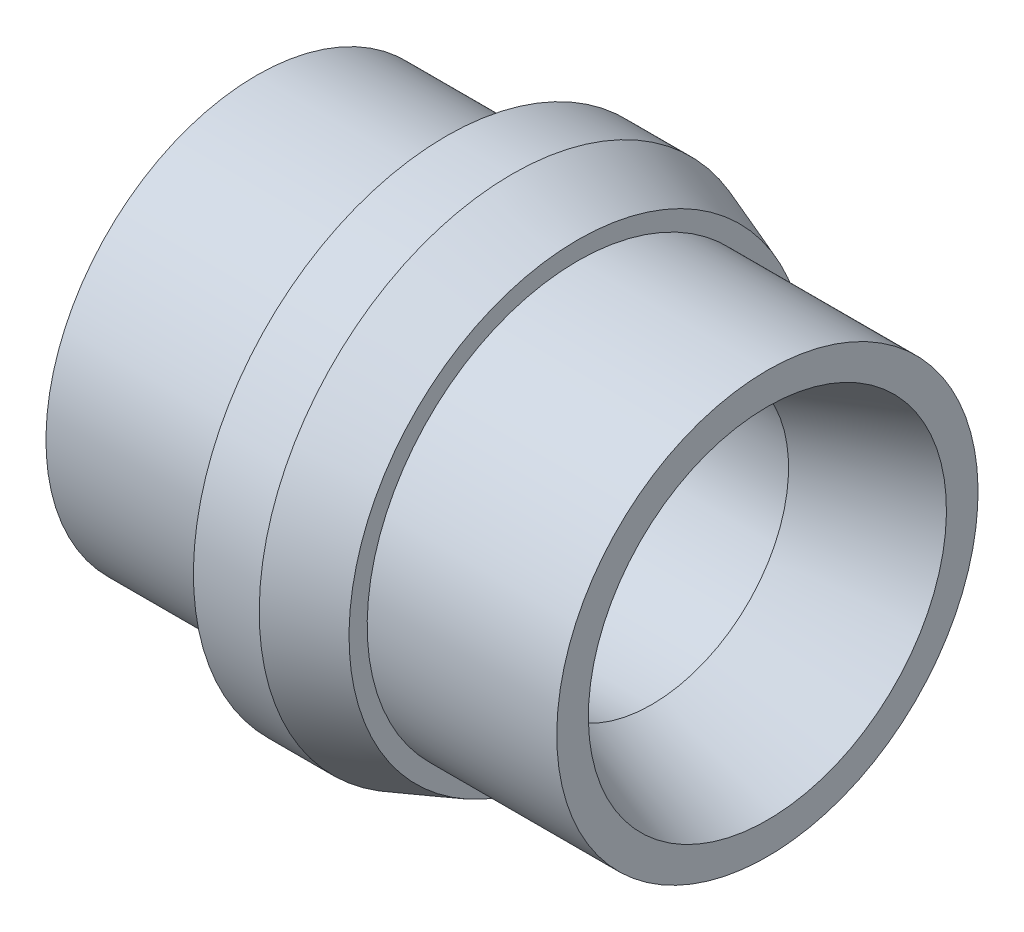
ISO-10303-21;
HEADER;
FILE_DESCRIPTION(('STEP AP214'),'2;1');
FILE_NAME('part.step','',(''),(''),'','','');
FILE_SCHEMA(('AUTOMOTIVE_DESIGN { 1 0 10303 214 1 1 1 1 }'));
ENDSEC;
DATA;
#1=APPLICATION_CONTEXT('core data for automotive mechanical design processes');
#2=APPLICATION_PROTOCOL_DEFINITION('international standard','automotive_design',2000,#1);
#3=PRODUCT_CONTEXT('',#1,'mechanical');
#4=PRODUCT('Part','Part','',(#3));
#5=PRODUCT_RELATED_PRODUCT_CATEGORY('part','',(#4));
#6=PRODUCT_DEFINITION_FORMATION('','',#4);
#7=PRODUCT_DEFINITION_CONTEXT('part definition',#1,'design');
#8=PRODUCT_DEFINITION('design','',#6,#7);
#9=PRODUCT_DEFINITION_SHAPE('','',#8);
#10=(LENGTH_UNIT() NAMED_UNIT(*) SI_UNIT(.MILLI.,.METRE.));
#11=(NAMED_UNIT(*) PLANE_ANGLE_UNIT() SI_UNIT($,.RADIAN.));
#12=(NAMED_UNIT(*) SI_UNIT($,.STERADIAN.) SOLID_ANGLE_UNIT());
#13=UNCERTAINTY_MEASURE_WITH_UNIT(LENGTH_MEASURE(1.E-05),#10,'distance_accuracy_value','');
#14=(GEOMETRIC_REPRESENTATION_CONTEXT(3) GLOBAL_UNCERTAINTY_ASSIGNED_CONTEXT((#13)) GLOBAL_UNIT_ASSIGNED_CONTEXT((#10,
#11,#12)) REPRESENTATION_CONTEXT('',''));
#15=CARTESIAN_POINT('',(0.,0.,0.));
#16=DIRECTION('',(0.,0.,1.));
#17=DIRECTION('',(1.,0.,0.));
#18=AXIS2_PLACEMENT_3D('',#15,#16,#17);
#19=CARTESIAN_POINT('',(0.,5.08,0.));
#20=DIRECTION('',(-1.,0.,0.));
#21=DIRECTION('',(0.,-1.,0.));
#22=AXIS2_PLACEMENT_3D('',#19,#20,#21);
#23=PLANE('',#22);
#24=CARTESIAN_POINT('',(0.,0.,0.));
#25=DIRECTION('',(-1.,0.,0.));
#26=DIRECTION('',(0.,1.,0.));
#27=AXIS2_PLACEMENT_3D('',#24,#25,#26);
#28=CIRCLE('',#27,5.08);
#29=CARTESIAN_POINT('',(0.,5.08,0.));
#30=VERTEX_POINT('',#29);
#31=EDGE_CURVE('E73',#30,#30,#28,.T.);
#32=ORIENTED_EDGE('',*,*,#31,.F.);
#33=EDGE_LOOP('',(#32));
#34=FACE_BOUND('',#33,.T.);
#35=CARTESIAN_POINT('',(0.,0.,0.));
#36=DIRECTION('',(-1.,0.,0.));
#37=DIRECTION('',(0.,1.,0.));
#38=AXIS2_PLACEMENT_3D('',#35,#36,#37);
#39=CIRCLE('',#38,6.096);
#40=CARTESIAN_POINT('',(0.,6.096,0.));
#41=VERTEX_POINT('',#40);
#42=EDGE_CURVE('E10',#41,#41,#39,.T.);
#43=ORIENTED_EDGE('',*,*,#42,.T.);
#44=EDGE_LOOP('',(#43));
#45=FACE_BOUND('',#44,.T.);
#46=ADVANCED_FACE('F39',(#34,#45),#23,.T.);
#47=CARTESIAN_POINT('',(3.86893060941692,0.,0.));
#48=DIRECTION('',(1.,0.,0.));
#49=DIRECTION('',(0.,1.,0.));
#50=AXIS2_PLACEMENT_3D('',#47,#48,#49);
#51=CYLINDRICAL_SURFACE('',#50,6.096);
#52=ORIENTED_EDGE('',*,*,#42,.F.);
#53=EDGE_LOOP('',(#52));
#54=FACE_BOUND('',#53,.T.);
#55=CARTESIAN_POINT('',(1.5875,0.,0.));
#56=DIRECTION('',(-1.,0.,0.));
#57=DIRECTION('',(0.,1.,0.));
#58=AXIS2_PLACEMENT_3D('',#55,#56,#57);
#59=CIRCLE('',#58,6.096);
#60=CARTESIAN_POINT('',(1.5875,6.096,0.));
#61=VERTEX_POINT('',#60);
#62=EDGE_CURVE('E45',#61,#61,#59,.T.);
#63=ORIENTED_EDGE('',*,*,#62,.T.);
#64=EDGE_LOOP('',(#63));
#65=FACE_BOUND('',#64,.T.);
#66=ADVANCED_FACE('F80',(#54,#65),#51,.T.);
#67=CARTESIAN_POINT('',(3.175,0.,0.));
#68=DIRECTION('',(-1.,0.,0.));
#69=DIRECTION('',(0.,-1.,0.));
#70=AXIS2_PLACEMENT_3D('',#67,#68,#69);
#71=CONICAL_SURFACE('',#70,5.5181972531024,0.349065850398867);
#72=ORIENTED_EDGE('',*,*,#62,.F.);
#73=EDGE_LOOP('',(#72));
#74=FACE_BOUND('',#73,.T.);
#75=CARTESIAN_POINT('',(3.175,0.,0.));
#76=DIRECTION('',(-1.,0.,0.));
#77=DIRECTION('',(0.,1.,0.));
#78=AXIS2_PLACEMENT_3D('',#75,#76,#77);
#79=CIRCLE('',#78,5.5181972531024);
#80=CARTESIAN_POINT('',(3.175,5.5181972531024,0.));
#81=VERTEX_POINT('',#80);
#82=EDGE_CURVE('E49',#81,#81,#79,.T.);
#83=ORIENTED_EDGE('',*,*,#82,.T.);
#84=EDGE_LOOP('',(#83));
#85=FACE_BOUND('',#84,.T.);
#86=ADVANCED_FACE('F84',(#74,#85),#71,.T.);
#87=CARTESIAN_POINT('',(3.175,5.5181972531024,0.));
#88=DIRECTION('',(1.,0.,0.));
#89=DIRECTION('',(0.,1.,0.));
#90=AXIS2_PLACEMENT_3D('',#87,#88,#89);
#91=PLANE('',#90);
#92=ORIENTED_EDGE('',*,*,#82,.F.);
#93=EDGE_LOOP('',(#92));
#94=FACE_BOUND('',#93,.T.);
#95=CARTESIAN_POINT('',(3.175,0.,0.));
#96=DIRECTION('',(-1.,0.,0.));
#97=DIRECTION('',(0.,1.,0.));
#98=AXIS2_PLACEMENT_3D('',#95,#96,#97);
#99=CIRCLE('',#98,5.08);
#100=CARTESIAN_POINT('',(3.175,5.08,0.));
#101=VERTEX_POINT('',#100);
#102=EDGE_CURVE('E53',#101,#101,#99,.T.);
#103=ORIENTED_EDGE('',*,*,#102,.T.);
#104=EDGE_LOOP('',(#103));
#105=FACE_BOUND('',#104,.T.);
#106=ADVANCED_FACE('F89',(#94,#105),#91,.T.);
#107=CARTESIAN_POINT('',(3.86893060941692,0.,0.));
#108=DIRECTION('',(1.,0.,0.));
#109=DIRECTION('',(0.,1.,0.));
#110=AXIS2_PLACEMENT_3D('',#107,#108,#109);
#111=CYLINDRICAL_SURFACE('',#110,5.08);
#112=ORIENTED_EDGE('',*,*,#102,.F.);
#113=EDGE_LOOP('',(#112));
#114=FACE_BOUND('',#113,.T.);
#115=CARTESIAN_POINT('',(7.747,0.,0.));
#116=DIRECTION('',(-1.,0.,0.));
#117=DIRECTION('',(0.,1.,0.));
#118=AXIS2_PLACEMENT_3D('',#115,#116,#117);
#119=CIRCLE('',#118,5.08);
#120=CARTESIAN_POINT('',(7.747,5.08,0.));
#121=VERTEX_POINT('',#120);
#122=EDGE_CURVE('E58',#121,#121,#119,.T.);
#123=ORIENTED_EDGE('',*,*,#122,.T.);
#124=EDGE_LOOP('',(#123));
#125=FACE_BOUND('',#124,.T.);
#126=ADVANCED_FACE('F95',(#114,#125),#111,.T.);
#127=CARTESIAN_POINT('',(7.747,5.08,0.));
#128=DIRECTION('',(1.,0.,0.));
#129=DIRECTION('',(0.,1.,0.));
#130=AXIS2_PLACEMENT_3D('',#127,#128,#129);
#131=PLANE('',#130);
#132=ORIENTED_EDGE('',*,*,#122,.F.);
#133=EDGE_LOOP('',(#132));
#134=FACE_BOUND('',#133,.T.);
#135=CARTESIAN_POINT('',(7.747,0.,0.));
#136=DIRECTION('',(-1.,0.,0.));
#137=DIRECTION('',(0.,1.,0.));
#138=AXIS2_PLACEMENT_3D('',#135,#136,#137);
#139=CIRCLE('',#138,4.318);
#140=CARTESIAN_POINT('',(7.747,4.318,0.));
#141=VERTEX_POINT('',#140);
#142=EDGE_CURVE('E61',#141,#141,#139,.T.);
#143=ORIENTED_EDGE('',*,*,#142,.T.);
#144=EDGE_LOOP('',(#143));
#145=FACE_BOUND('',#144,.T.);
#146=ADVANCED_FACE('F99',(#134,#145),#131,.T.);
#147=CARTESIAN_POINT('',(4.95556294183411,0.,0.));
#148=DIRECTION('',(1.,0.,0.));
#149=DIRECTION('',(0.,1.,0.));
#150=AXIS2_PLACEMENT_3D('',#147,#148,#149);
#151=CONICAL_SURFACE('',#150,3.302,0.349065850398866);
#152=ORIENTED_EDGE('',*,*,#142,.F.);
#153=EDGE_LOOP('',(#152));
#154=FACE_BOUND('',#153,.T.);
#155=CARTESIAN_POINT('',(4.95556294183411,0.,0.));
#156=DIRECTION('',(-1.,0.,0.));
#157=DIRECTION('',(0.,1.,0.));
#158=AXIS2_PLACEMENT_3D('',#155,#156,#157);
#159=CIRCLE('',#158,3.302);
#160=CARTESIAN_POINT('',(4.95556294183411,3.302,0.));
#161=VERTEX_POINT('',#160);
#162=EDGE_CURVE('E64',#161,#161,#159,.T.);
#163=ORIENTED_EDGE('',*,*,#162,.T.);
#164=EDGE_LOOP('',(#163));
#165=FACE_BOUND('',#164,.T.);
#166=ADVANCED_FACE('F103',(#154,#165),#151,.F.);
#167=CARTESIAN_POINT('',(3.86893060941692,0.,0.));
#168=DIRECTION('',(1.,0.,0.));
#169=DIRECTION('',(0.,1.,0.));
#170=AXIS2_PLACEMENT_3D('',#167,#168,#169);
#171=CYLINDRICAL_SURFACE('',#170,3.302);
#172=ORIENTED_EDGE('',*,*,#162,.F.);
#173=EDGE_LOOP('',(#172));
#174=FACE_BOUND('',#173,.T.);
#175=CARTESIAN_POINT('',(-4.572,0.,0.));
#176=DIRECTION('',(-1.,0.,0.));
#177=DIRECTION('',(0.,1.,0.));
#178=AXIS2_PLACEMENT_3D('',#175,#176,#177);
#179=CIRCLE('',#178,3.302);
#180=CARTESIAN_POINT('',(-4.572,3.302,0.));
#181=VERTEX_POINT('',#180);
#182=EDGE_CURVE('E67',#181,#181,#179,.T.);
#183=ORIENTED_EDGE('',*,*,#182,.T.);
#184=EDGE_LOOP('',(#183));
#185=FACE_BOUND('',#184,.T.);
#186=ADVANCED_FACE('F107',(#174,#185),#171,.F.);
#187=CARTESIAN_POINT('',(-4.572,3.302,0.));
#188=DIRECTION('',(-1.,0.,0.));
#189=DIRECTION('',(0.,-1.,0.));
#190=AXIS2_PLACEMENT_3D('',#187,#188,#189);
#191=PLANE('',#190);
#192=ORIENTED_EDGE('',*,*,#182,.F.);
#193=EDGE_LOOP('',(#192));
#194=FACE_BOUND('',#193,.T.);
#195=CARTESIAN_POINT('',(-4.572,0.,0.));
#196=DIRECTION('',(-1.,0.,0.));
#197=DIRECTION('',(0.,1.,0.));
#198=AXIS2_PLACEMENT_3D('',#195,#196,#197);
#199=CIRCLE('',#198,5.08);
#200=CARTESIAN_POINT('',(-4.572,5.08,0.));
#201=VERTEX_POINT('',#200);
#202=EDGE_CURVE('E70',#201,#201,#199,.T.);
#203=ORIENTED_EDGE('',*,*,#202,.T.);
#204=EDGE_LOOP('',(#203));
#205=FACE_BOUND('',#204,.T.);
#206=ADVANCED_FACE('F111',(#194,#205),#191,.T.);
#207=CARTESIAN_POINT('',(3.86893060941692,0.,0.));
#208=DIRECTION('',(1.,0.,0.));
#209=DIRECTION('',(0.,1.,0.));
#210=AXIS2_PLACEMENT_3D('',#207,#208,#209);
#211=CYLINDRICAL_SURFACE('',#210,5.08);
#212=ORIENTED_EDGE('',*,*,#202,.F.);
#213=EDGE_LOOP('',(#212));
#214=FACE_BOUND('',#213,.T.);
#215=ORIENTED_EDGE('',*,*,#31,.T.);
#216=EDGE_LOOP('',(#215));
#217=FACE_BOUND('',#216,.T.);
#218=ADVANCED_FACE('F77',(#214,#217),#211,.T.);
#219=CLOSED_SHELL('',(#46,#66,#86,#106,#126,#146,#166,#186,#206,#218));
#220=MANIFOLD_SOLID_BREP('B2',#219);
#221=ADVANCED_BREP_SHAPE_REPRESENTATION('',(#18,#220),#14);
#222=SHAPE_DEFINITION_REPRESENTATION(#9,#221);
ENDSEC;
END-ISO-10303-21;
